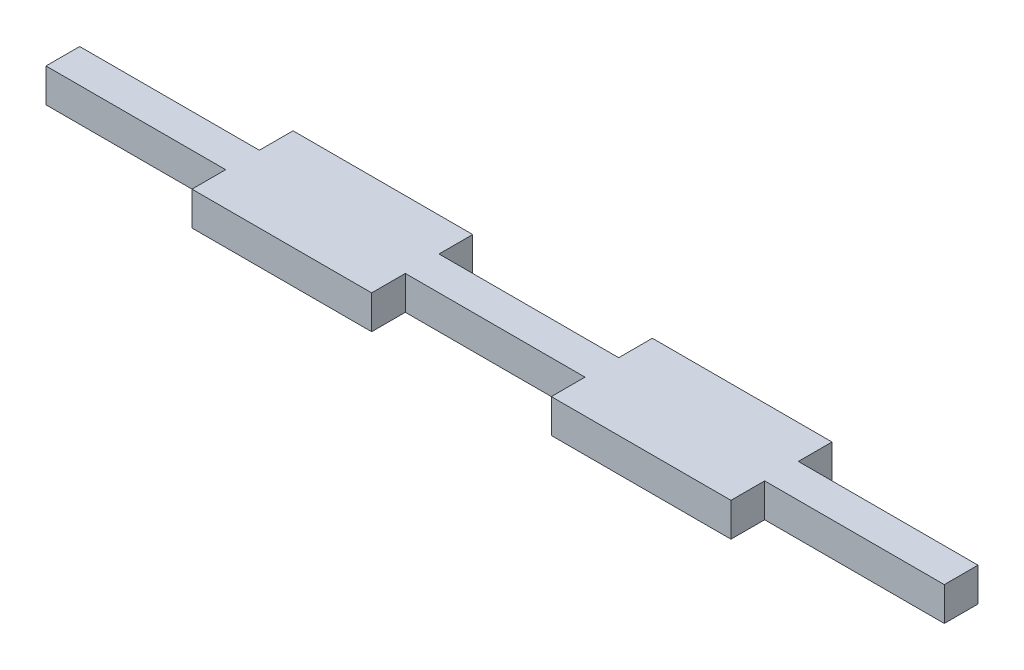
ISO-10303-21;
HEADER;
FILE_DESCRIPTION(('STEP AP214'),'2;1');
FILE_NAME('part.step','',(''),(''),'','','');
FILE_SCHEMA(('AUTOMOTIVE_DESIGN { 1 0 10303 214 1 1 1 1 }'));
ENDSEC;
DATA;
#1=APPLICATION_CONTEXT('core data for automotive mechanical design processes');
#2=APPLICATION_PROTOCOL_DEFINITION('international standard','automotive_design',2000,#1);
#3=PRODUCT_CONTEXT('',#1,'mechanical');
#4=PRODUCT('Part','Part','',(#3));
#5=PRODUCT_RELATED_PRODUCT_CATEGORY('part','',(#4));
#6=PRODUCT_DEFINITION_FORMATION('','',#4);
#7=PRODUCT_DEFINITION_CONTEXT('part definition',#1,'design');
#8=PRODUCT_DEFINITION('design','',#6,#7);
#9=PRODUCT_DEFINITION_SHAPE('','',#8);
#10=(LENGTH_UNIT() NAMED_UNIT(*) SI_UNIT(.MILLI.,.METRE.));
#11=(NAMED_UNIT(*) PLANE_ANGLE_UNIT() SI_UNIT($,.RADIAN.));
#12=(NAMED_UNIT(*) SI_UNIT($,.STERADIAN.) SOLID_ANGLE_UNIT());
#13=UNCERTAINTY_MEASURE_WITH_UNIT(LENGTH_MEASURE(1.E-05),#10,'distance_accuracy_value','');
#14=(GEOMETRIC_REPRESENTATION_CONTEXT(3) GLOBAL_UNCERTAINTY_ASSIGNED_CONTEXT((#13)) GLOBAL_UNIT_ASSIGNED_CONTEXT((#10,
#11,#12)) REPRESENTATION_CONTEXT('',''));
#15=CARTESIAN_POINT('',(0.,0.,0.));
#16=DIRECTION('',(0.,0.,1.));
#17=DIRECTION('',(1.,0.,0.));
#18=AXIS2_PLACEMENT_3D('',#15,#16,#17);
#19=CARTESIAN_POINT('',(-24.,3.,-1.5));
#20=DIRECTION('',(1.,0.,0.));
#21=DIRECTION('',(0.,0.,-1.));
#22=AXIS2_PLACEMENT_3D('',#19,#20,#21);
#23=PLANE('',#22);
#24=DIRECTION('',(0.,0.,1.));
#25=VECTOR('',#24,1.);
#26=CARTESIAN_POINT('',(-24.,0.,-1.5));
#27=LINE('',#26,#25);
#28=CARTESIAN_POINT('',(-24.,0.,-4.5));
#29=VERTEX_POINT('',#28);
#30=CARTESIAN_POINT('',(-24.,0.,-1.5));
#31=VERTEX_POINT('',#30);
#32=EDGE_CURVE('E201',#29,#31,#27,.T.);
#33=ORIENTED_EDGE('',*,*,#32,.T.);
#34=DIRECTION('',(0.,-1.,0.));
#35=VECTOR('',#34,1.);
#36=CARTESIAN_POINT('',(-24.,3.,-1.5));
#37=LINE('',#36,#35);
#38=CARTESIAN_POINT('',(-24.,3.,-1.5));
#39=VERTEX_POINT('',#38);
#40=EDGE_CURVE('E11',#39,#31,#37,.T.);
#41=ORIENTED_EDGE('',*,*,#40,.F.);
#42=DIRECTION('',(0.,0.,1.));
#43=VECTOR('',#42,1.);
#44=CARTESIAN_POINT('',(-24.,3.,-1.5));
#45=LINE('',#44,#43);
#46=CARTESIAN_POINT('',(-24.,3.,-4.5));
#47=VERTEX_POINT('',#46);
#48=EDGE_CURVE('E239',#47,#39,#45,.T.);
#49=ORIENTED_EDGE('',*,*,#48,.F.);
#50=DIRECTION('',(0.,-1.,0.));
#51=VECTOR('',#50,1.);
#52=CARTESIAN_POINT('',(-24.,3.,-4.5));
#53=LINE('',#52,#51);
#54=EDGE_CURVE('E197',#47,#29,#53,.T.);
#55=ORIENTED_EDGE('',*,*,#54,.T.);
#56=EDGE_LOOP('',(#33,#41,#49,#55));
#57=FACE_BOUND('',#56,.T.);
#58=ADVANCED_FACE('F33',(#57),#23,.F.);
#59=CARTESIAN_POINT('',(-40.,3.,-1.5));
#60=DIRECTION('',(0.,0.,1.));
#61=DIRECTION('',(1.,0.,0.));
#62=AXIS2_PLACEMENT_3D('',#59,#60,#61);
#63=PLANE('',#62);
#64=DIRECTION('',(-1.,0.,0.));
#65=VECTOR('',#64,1.);
#66=CARTESIAN_POINT('',(-40.,0.,-1.5));
#67=LINE('',#66,#65);
#68=CARTESIAN_POINT('',(-40.,0.,-1.5));
#69=VERTEX_POINT('',#68);
#70=EDGE_CURVE('E204',#31,#69,#67,.T.);
#71=ORIENTED_EDGE('',*,*,#70,.T.);
#72=DIRECTION('',(0.,-1.,0.));
#73=VECTOR('',#72,1.);
#74=CARTESIAN_POINT('',(-40.,3.,-1.5));
#75=LINE('',#74,#73);
#76=CARTESIAN_POINT('',(-40.,3.,-1.5));
#77=VERTEX_POINT('',#76);
#78=EDGE_CURVE('E41',#77,#69,#75,.T.);
#79=ORIENTED_EDGE('',*,*,#78,.F.);
#80=DIRECTION('',(-1.,0.,0.));
#81=VECTOR('',#80,1.);
#82=CARTESIAN_POINT('',(-40.,3.,-1.5));
#83=LINE('',#82,#81);
#84=EDGE_CURVE('E128',#39,#77,#83,.T.);
#85=ORIENTED_EDGE('',*,*,#84,.F.);
#86=ORIENTED_EDGE('',*,*,#40,.T.);
#87=EDGE_LOOP('',(#71,#79,#85,#86));
#88=FACE_BOUND('',#87,.T.);
#89=ADVANCED_FACE('F357',(#88),#63,.F.);
#90=CARTESIAN_POINT('',(-40.,3.,1.5));
#91=DIRECTION('',(1.,0.,0.));
#92=DIRECTION('',(0.,0.,-1.));
#93=AXIS2_PLACEMENT_3D('',#90,#91,#92);
#94=PLANE('',#93);
#95=DIRECTION('',(0.,0.,1.));
#96=VECTOR('',#95,1.);
#97=CARTESIAN_POINT('',(-40.,0.,1.5));
#98=LINE('',#97,#96);
#99=CARTESIAN_POINT('',(-40.,0.,1.5));
#100=VERTEX_POINT('',#99);
#101=EDGE_CURVE('E206',#69,#100,#98,.T.);
#102=ORIENTED_EDGE('',*,*,#101,.T.);
#103=DIRECTION('',(0.,-1.,0.));
#104=VECTOR('',#103,1.);
#105=CARTESIAN_POINT('',(-40.,3.,1.5));
#106=LINE('',#105,#104);
#107=CARTESIAN_POINT('',(-40.,3.,1.5));
#108=VERTEX_POINT('',#107);
#109=EDGE_CURVE('E282',#108,#100,#106,.T.);
#110=ORIENTED_EDGE('',*,*,#109,.F.);
#111=DIRECTION('',(0.,0.,1.));
#112=VECTOR('',#111,1.);
#113=CARTESIAN_POINT('',(-40.,3.,1.5));
#114=LINE('',#113,#112);
#115=EDGE_CURVE('E290',#77,#108,#114,.T.);
#116=ORIENTED_EDGE('',*,*,#115,.F.);
#117=ORIENTED_EDGE('',*,*,#78,.T.);
#118=EDGE_LOOP('',(#102,#110,#116,#117));
#119=FACE_BOUND('',#118,.T.);
#120=ADVANCED_FACE('F288',(#119),#94,.F.);
#121=CARTESIAN_POINT('',(-24.,3.,1.5));
#122=DIRECTION('',(0.,0.,-1.));
#123=DIRECTION('',(-1.,0.,0.));
#124=AXIS2_PLACEMENT_3D('',#121,#122,#123);
#125=PLANE('',#124);
#126=DIRECTION('',(1.,0.,0.));
#127=VECTOR('',#126,1.);
#128=CARTESIAN_POINT('',(-24.,0.,1.5));
#129=LINE('',#128,#127);
#130=CARTESIAN_POINT('',(-24.,0.,1.5));
#131=VERTEX_POINT('',#130);
#132=EDGE_CURVE('E208',#100,#131,#129,.T.);
#133=ORIENTED_EDGE('',*,*,#132,.T.);
#134=DIRECTION('',(0.,-1.,0.));
#135=VECTOR('',#134,1.);
#136=CARTESIAN_POINT('',(-24.,3.,1.5));
#137=LINE('',#136,#135);
#138=CARTESIAN_POINT('',(-24.,3.,1.5));
#139=VERTEX_POINT('',#138);
#140=EDGE_CURVE('E279',#139,#131,#137,.T.);
#141=ORIENTED_EDGE('',*,*,#140,.F.);
#142=DIRECTION('',(1.,0.,0.));
#143=VECTOR('',#142,1.);
#144=CARTESIAN_POINT('',(-24.,3.,1.5));
#145=LINE('',#144,#143);
#146=EDGE_CURVE('E308',#108,#139,#145,.T.);
#147=ORIENTED_EDGE('',*,*,#146,.F.);
#148=ORIENTED_EDGE('',*,*,#109,.T.);
#149=EDGE_LOOP('',(#133,#141,#147,#148));
#150=FACE_BOUND('',#149,.T.);
#151=ADVANCED_FACE('F299',(#150),#125,.F.);
#152=CARTESIAN_POINT('',(-24.,3.,4.5));
#153=DIRECTION('',(1.,0.,0.));
#154=DIRECTION('',(0.,0.,-1.));
#155=AXIS2_PLACEMENT_3D('',#152,#153,#154);
#156=PLANE('',#155);
#157=DIRECTION('',(0.,0.,1.));
#158=VECTOR('',#157,1.);
#159=CARTESIAN_POINT('',(-24.,0.,4.5));
#160=LINE('',#159,#158);
#161=CARTESIAN_POINT('',(-24.,0.,4.5));
#162=VERTEX_POINT('',#161);
#163=EDGE_CURVE('E210',#131,#162,#160,.T.);
#164=ORIENTED_EDGE('',*,*,#163,.T.);
#165=DIRECTION('',(0.,-1.,0.));
#166=VECTOR('',#165,1.);
#167=CARTESIAN_POINT('',(-24.,3.,4.5));
#168=LINE('',#167,#166);
#169=CARTESIAN_POINT('',(-24.,3.,4.5));
#170=VERTEX_POINT('',#169);
#171=EDGE_CURVE('E276',#170,#162,#168,.T.);
#172=ORIENTED_EDGE('',*,*,#171,.F.);
#173=DIRECTION('',(0.,0.,1.));
#174=VECTOR('',#173,1.);
#175=CARTESIAN_POINT('',(-24.,3.,4.5));
#176=LINE('',#175,#174);
#177=EDGE_CURVE('E305',#139,#170,#176,.T.);
#178=ORIENTED_EDGE('',*,*,#177,.F.);
#179=ORIENTED_EDGE('',*,*,#140,.T.);
#180=EDGE_LOOP('',(#164,#172,#178,#179));
#181=FACE_BOUND('',#180,.T.);
#182=ADVANCED_FACE('F303',(#181),#156,.F.);
#183=CARTESIAN_POINT('',(-24.,3.,4.5));
#184=DIRECTION('',(0.,0.,-1.));
#185=DIRECTION('',(-1.,0.,0.));
#186=AXIS2_PLACEMENT_3D('',#183,#184,#185);
#187=PLANE('',#186);
#188=DIRECTION('',(1.,0.,0.));
#189=VECTOR('',#188,1.);
#190=CARTESIAN_POINT('',(-24.,0.,4.5));
#191=LINE('',#190,#189);
#192=CARTESIAN_POINT('',(-8.00000000000001,0.,4.5));
#193=VERTEX_POINT('',#192);
#194=EDGE_CURVE('E212',#162,#193,#191,.T.);
#195=ORIENTED_EDGE('',*,*,#194,.T.);
#196=DIRECTION('',(0.,-1.,0.));
#197=VECTOR('',#196,1.);
#198=CARTESIAN_POINT('',(-8.00000000000001,3.,4.5));
#199=LINE('',#198,#197);
#200=CARTESIAN_POINT('',(-8.00000000000001,3.,4.5));
#201=VERTEX_POINT('',#200);
#202=EDGE_CURVE('E273',#201,#193,#199,.T.);
#203=ORIENTED_EDGE('',*,*,#202,.F.);
#204=DIRECTION('',(1.,0.,0.));
#205=VECTOR('',#204,1.);
#206=CARTESIAN_POINT('',(-24.,3.,4.5));
#207=LINE('',#206,#205);
#208=EDGE_CURVE('E307',#170,#201,#207,.T.);
#209=ORIENTED_EDGE('',*,*,#208,.F.);
#210=ORIENTED_EDGE('',*,*,#171,.T.);
#211=EDGE_LOOP('',(#195,#203,#209,#210));
#212=FACE_BOUND('',#211,.T.);
#213=ADVANCED_FACE('F370',(#212),#187,.F.);
#214=CARTESIAN_POINT('',(-8.00000000000001,3.,4.5));
#215=DIRECTION('',(-1.,0.,0.));
#216=DIRECTION('',(0.,0.,1.));
#217=AXIS2_PLACEMENT_3D('',#214,#215,#216);
#218=PLANE('',#217);
#219=DIRECTION('',(0.,0.,-1.));
#220=VECTOR('',#219,1.);
#221=CARTESIAN_POINT('',(-8.00000000000001,0.,4.5));
#222=LINE('',#221,#220);
#223=CARTESIAN_POINT('',(-8.00000000000001,0.,1.5));
#224=VERTEX_POINT('',#223);
#225=EDGE_CURVE('E214',#193,#224,#222,.T.);
#226=ORIENTED_EDGE('',*,*,#225,.T.);
#227=DIRECTION('',(0.,-1.,0.));
#228=VECTOR('',#227,1.);
#229=CARTESIAN_POINT('',(-8.00000000000001,3.,1.5));
#230=LINE('',#229,#228);
#231=CARTESIAN_POINT('',(-8.00000000000001,3.,1.5));
#232=VERTEX_POINT('',#231);
#233=EDGE_CURVE('E270',#232,#224,#230,.T.);
#234=ORIENTED_EDGE('',*,*,#233,.F.);
#235=DIRECTION('',(0.,0.,-1.));
#236=VECTOR('',#235,1.);
#237=CARTESIAN_POINT('',(-8.00000000000001,3.,4.5));
#238=LINE('',#237,#236);
#239=EDGE_CURVE('E310',#201,#232,#238,.T.);
#240=ORIENTED_EDGE('',*,*,#239,.F.);
#241=ORIENTED_EDGE('',*,*,#202,.T.);
#242=EDGE_LOOP('',(#226,#234,#240,#241));
#243=FACE_BOUND('',#242,.T.);
#244=ADVANCED_FACE('F373',(#243),#218,.F.);
#245=CARTESIAN_POINT('',(-8.00000000000001,3.,1.5));
#246=DIRECTION('',(0.,0.,-1.));
#247=DIRECTION('',(-1.,0.,0.));
#248=AXIS2_PLACEMENT_3D('',#245,#246,#247);
#249=PLANE('',#248);
#250=DIRECTION('',(1.,0.,0.));
#251=VECTOR('',#250,1.);
#252=CARTESIAN_POINT('',(-8.00000000000001,0.,1.5));
#253=LINE('',#252,#251);
#254=CARTESIAN_POINT('',(7.99999999999999,0.,1.5));
#255=VERTEX_POINT('',#254);
#256=EDGE_CURVE('E216',#224,#255,#253,.T.);
#257=ORIENTED_EDGE('',*,*,#256,.T.);
#258=DIRECTION('',(0.,-1.,0.));
#259=VECTOR('',#258,1.);
#260=CARTESIAN_POINT('',(7.99999999999999,3.,1.5));
#261=LINE('',#260,#259);
#262=CARTESIAN_POINT('',(7.99999999999999,3.,1.5));
#263=VERTEX_POINT('',#262);
#264=EDGE_CURVE('E267',#263,#255,#261,.T.);
#265=ORIENTED_EDGE('',*,*,#264,.F.);
#266=DIRECTION('',(1.,0.,0.));
#267=VECTOR('',#266,1.);
#268=CARTESIAN_POINT('',(-8.00000000000001,3.,1.5));
#269=LINE('',#268,#267);
#270=EDGE_CURVE('E316',#232,#263,#269,.T.);
#271=ORIENTED_EDGE('',*,*,#270,.F.);
#272=ORIENTED_EDGE('',*,*,#233,.T.);
#273=EDGE_LOOP('',(#257,#265,#271,#272));
#274=FACE_BOUND('',#273,.T.);
#275=ADVANCED_FACE('F377',(#274),#249,.F.);
#276=CARTESIAN_POINT('',(7.99999999999999,3.,1.5));
#277=DIRECTION('',(1.,0.,0.));
#278=DIRECTION('',(0.,0.,-1.));
#279=AXIS2_PLACEMENT_3D('',#276,#277,#278);
#280=PLANE('',#279);
#281=DIRECTION('',(0.,0.,1.));
#282=VECTOR('',#281,1.);
#283=CARTESIAN_POINT('',(7.99999999999999,0.,1.5));
#284=LINE('',#283,#282);
#285=CARTESIAN_POINT('',(7.99999999999999,0.,4.5));
#286=VERTEX_POINT('',#285);
#287=EDGE_CURVE('E218',#255,#286,#284,.T.);
#288=ORIENTED_EDGE('',*,*,#287,.T.);
#289=DIRECTION('',(0.,-1.,0.));
#290=VECTOR('',#289,1.);
#291=CARTESIAN_POINT('',(7.99999999999999,3.,4.5));
#292=LINE('',#291,#290);
#293=CARTESIAN_POINT('',(7.99999999999999,3.,4.5));
#294=VERTEX_POINT('',#293);
#295=EDGE_CURVE('E264',#294,#286,#292,.T.);
#296=ORIENTED_EDGE('',*,*,#295,.F.);
#297=DIRECTION('',(0.,0.,1.));
#298=VECTOR('',#297,1.);
#299=CARTESIAN_POINT('',(7.99999999999999,3.,1.5));
#300=LINE('',#299,#298);
#301=EDGE_CURVE('E318',#263,#294,#300,.T.);
#302=ORIENTED_EDGE('',*,*,#301,.F.);
#303=ORIENTED_EDGE('',*,*,#264,.T.);
#304=EDGE_LOOP('',(#288,#296,#302,#303));
#305=FACE_BOUND('',#304,.T.);
#306=ADVANCED_FACE('F381',(#305),#280,.F.);
#307=CARTESIAN_POINT('',(7.99999999999999,3.,4.5));
#308=DIRECTION('',(0.,0.,-1.));
#309=DIRECTION('',(-1.,0.,0.));
#310=AXIS2_PLACEMENT_3D('',#307,#308,#309);
#311=PLANE('',#310);
#312=DIRECTION('',(1.,0.,0.));
#313=VECTOR('',#312,1.);
#314=CARTESIAN_POINT('',(7.99999999999999,0.,4.5));
#315=LINE('',#314,#313);
#316=CARTESIAN_POINT('',(24.,0.,4.5));
#317=VERTEX_POINT('',#316);
#318=EDGE_CURVE('E220',#286,#317,#315,.T.);
#319=ORIENTED_EDGE('',*,*,#318,.T.);
#320=DIRECTION('',(0.,-1.,0.));
#321=VECTOR('',#320,1.);
#322=CARTESIAN_POINT('',(24.,3.,4.5));
#323=LINE('',#322,#321);
#324=CARTESIAN_POINT('',(24.,3.,4.5));
#325=VERTEX_POINT('',#324);
#326=EDGE_CURVE('E261',#325,#317,#323,.T.);
#327=ORIENTED_EDGE('',*,*,#326,.F.);
#328=DIRECTION('',(1.,0.,0.));
#329=VECTOR('',#328,1.);
#330=CARTESIAN_POINT('',(7.99999999999999,3.,4.5));
#331=LINE('',#330,#329);
#332=EDGE_CURVE('E320',#294,#325,#331,.T.);
#333=ORIENTED_EDGE('',*,*,#332,.F.);
#334=ORIENTED_EDGE('',*,*,#295,.T.);
#335=EDGE_LOOP('',(#319,#327,#333,#334));
#336=FACE_BOUND('',#335,.T.);
#337=ADVANCED_FACE('F385',(#336),#311,.F.);
#338=CARTESIAN_POINT('',(24.,3.,4.5));
#339=DIRECTION('',(-1.,0.,0.));
#340=DIRECTION('',(0.,0.,1.));
#341=AXIS2_PLACEMENT_3D('',#338,#339,#340);
#342=PLANE('',#341);
#343=DIRECTION('',(0.,0.,-1.));
#344=VECTOR('',#343,1.);
#345=CARTESIAN_POINT('',(24.,0.,4.5));
#346=LINE('',#345,#344);
#347=CARTESIAN_POINT('',(24.,0.,1.5));
#348=VERTEX_POINT('',#347);
#349=EDGE_CURVE('E222',#317,#348,#346,.T.);
#350=ORIENTED_EDGE('',*,*,#349,.T.);
#351=DIRECTION('',(0.,-1.,0.));
#352=VECTOR('',#351,1.);
#353=CARTESIAN_POINT('',(24.,3.,1.5));
#354=LINE('',#353,#352);
#355=CARTESIAN_POINT('',(24.,3.,1.5));
#356=VERTEX_POINT('',#355);
#357=EDGE_CURVE('E258',#356,#348,#354,.T.);
#358=ORIENTED_EDGE('',*,*,#357,.F.);
#359=DIRECTION('',(0.,0.,-1.));
#360=VECTOR('',#359,1.);
#361=CARTESIAN_POINT('',(24.,3.,4.5));
#362=LINE('',#361,#360);
#363=EDGE_CURVE('E322',#325,#356,#362,.T.);
#364=ORIENTED_EDGE('',*,*,#363,.F.);
#365=ORIENTED_EDGE('',*,*,#326,.T.);
#366=EDGE_LOOP('',(#350,#358,#364,#365));
#367=FACE_BOUND('',#366,.T.);
#368=ADVANCED_FACE('F389',(#367),#342,.F.);
#369=CARTESIAN_POINT('',(24.,3.,1.5));
#370=DIRECTION('',(0.,0.,-1.));
#371=DIRECTION('',(-1.,0.,0.));
#372=AXIS2_PLACEMENT_3D('',#369,#370,#371);
#373=PLANE('',#372);
#374=DIRECTION('',(1.,0.,0.));
#375=VECTOR('',#374,1.);
#376=CARTESIAN_POINT('',(24.,0.,1.5));
#377=LINE('',#376,#375);
#378=CARTESIAN_POINT('',(40.,0.,1.5));
#379=VERTEX_POINT('',#378);
#380=EDGE_CURVE('E224',#348,#379,#377,.T.);
#381=ORIENTED_EDGE('',*,*,#380,.T.);
#382=DIRECTION('',(0.,-1.,0.));
#383=VECTOR('',#382,1.);
#384=CARTESIAN_POINT('',(40.,3.,1.5));
#385=LINE('',#384,#383);
#386=CARTESIAN_POINT('',(40.,3.,1.5));
#387=VERTEX_POINT('',#386);
#388=EDGE_CURVE('E255',#387,#379,#385,.T.);
#389=ORIENTED_EDGE('',*,*,#388,.F.);
#390=DIRECTION('',(1.,0.,0.));
#391=VECTOR('',#390,1.);
#392=CARTESIAN_POINT('',(24.,3.,1.5));
#393=LINE('',#392,#391);
#394=EDGE_CURVE('E324',#356,#387,#393,.T.);
#395=ORIENTED_EDGE('',*,*,#394,.F.);
#396=ORIENTED_EDGE('',*,*,#357,.T.);
#397=EDGE_LOOP('',(#381,#389,#395,#396));
#398=FACE_BOUND('',#397,.T.);
#399=ADVANCED_FACE('F393',(#398),#373,.F.);
#400=CARTESIAN_POINT('',(40.,3.,1.5));
#401=DIRECTION('',(-1.,0.,0.));
#402=DIRECTION('',(0.,0.,1.));
#403=AXIS2_PLACEMENT_3D('',#400,#401,#402);
#404=PLANE('',#403);
#405=DIRECTION('',(0.,0.,-1.));
#406=VECTOR('',#405,1.);
#407=CARTESIAN_POINT('',(40.,0.,1.5));
#408=LINE('',#407,#406);
#409=CARTESIAN_POINT('',(40.,0.,-1.5));
#410=VERTEX_POINT('',#409);
#411=EDGE_CURVE('E226',#379,#410,#408,.T.);
#412=ORIENTED_EDGE('',*,*,#411,.T.);
#413=DIRECTION('',(0.,-1.,0.));
#414=VECTOR('',#413,1.);
#415=CARTESIAN_POINT('',(40.,3.,-1.5));
#416=LINE('',#415,#414);
#417=CARTESIAN_POINT('',(40.,3.,-1.5));
#418=VERTEX_POINT('',#417);
#419=EDGE_CURVE('E252',#418,#410,#416,.T.);
#420=ORIENTED_EDGE('',*,*,#419,.F.);
#421=DIRECTION('',(0.,0.,-1.));
#422=VECTOR('',#421,1.);
#423=CARTESIAN_POINT('',(40.,3.,1.5));
#424=LINE('',#423,#422);
#425=EDGE_CURVE('E326',#387,#418,#424,.T.);
#426=ORIENTED_EDGE('',*,*,#425,.F.);
#427=ORIENTED_EDGE('',*,*,#388,.T.);
#428=EDGE_LOOP('',(#412,#420,#426,#427));
#429=FACE_BOUND('',#428,.T.);
#430=ADVANCED_FACE('F397',(#429),#404,.F.);
#431=CARTESIAN_POINT('',(24.,3.,-1.5));
#432=DIRECTION('',(0.,0.,1.));
#433=DIRECTION('',(1.,0.,0.));
#434=AXIS2_PLACEMENT_3D('',#431,#432,#433);
#435=PLANE('',#434);
#436=DIRECTION('',(-1.,0.,0.));
#437=VECTOR('',#436,1.);
#438=CARTESIAN_POINT('',(24.,0.,-1.5));
#439=LINE('',#438,#437);
#440=CARTESIAN_POINT('',(24.,0.,-1.5));
#441=VERTEX_POINT('',#440);
#442=EDGE_CURVE('E228',#410,#441,#439,.T.);
#443=ORIENTED_EDGE('',*,*,#442,.T.);
#444=DIRECTION('',(0.,-1.,0.));
#445=VECTOR('',#444,1.);
#446=CARTESIAN_POINT('',(24.,3.,-1.5));
#447=LINE('',#446,#445);
#448=CARTESIAN_POINT('',(24.,3.,-1.5));
#449=VERTEX_POINT('',#448);
#450=EDGE_CURVE('E249',#449,#441,#447,.T.);
#451=ORIENTED_EDGE('',*,*,#450,.F.);
#452=DIRECTION('',(-1.,0.,0.));
#453=VECTOR('',#452,1.);
#454=CARTESIAN_POINT('',(24.,3.,-1.5));
#455=LINE('',#454,#453);
#456=EDGE_CURVE('E328',#418,#449,#455,.T.);
#457=ORIENTED_EDGE('',*,*,#456,.F.);
#458=ORIENTED_EDGE('',*,*,#419,.T.);
#459=EDGE_LOOP('',(#443,#451,#457,#458));
#460=FACE_BOUND('',#459,.T.);
#461=ADVANCED_FACE('F401',(#460),#435,.F.);
#462=CARTESIAN_POINT('',(24.,3.,-4.5));
#463=DIRECTION('',(-1.,0.,0.));
#464=DIRECTION('',(0.,0.,1.));
#465=AXIS2_PLACEMENT_3D('',#462,#463,#464);
#466=PLANE('',#465);
#467=DIRECTION('',(0.,0.,-1.));
#468=VECTOR('',#467,1.);
#469=CARTESIAN_POINT('',(24.,0.,-4.5));
#470=LINE('',#469,#468);
#471=CARTESIAN_POINT('',(24.,0.,-4.5));
#472=VERTEX_POINT('',#471);
#473=EDGE_CURVE('E230',#441,#472,#470,.T.);
#474=ORIENTED_EDGE('',*,*,#473,.T.);
#475=DIRECTION('',(0.,-1.,0.));
#476=VECTOR('',#475,1.);
#477=CARTESIAN_POINT('',(24.,3.,-4.5));
#478=LINE('',#477,#476);
#479=CARTESIAN_POINT('',(24.,3.,-4.5));
#480=VERTEX_POINT('',#479);
#481=EDGE_CURVE('E246',#480,#472,#478,.T.);
#482=ORIENTED_EDGE('',*,*,#481,.F.);
#483=DIRECTION('',(0.,0.,-1.));
#484=VECTOR('',#483,1.);
#485=CARTESIAN_POINT('',(24.,3.,-4.5));
#486=LINE('',#485,#484);
#487=EDGE_CURVE('E330',#449,#480,#486,.T.);
#488=ORIENTED_EDGE('',*,*,#487,.F.);
#489=ORIENTED_EDGE('',*,*,#450,.T.);
#490=EDGE_LOOP('',(#474,#482,#488,#489));
#491=FACE_BOUND('',#490,.T.);
#492=ADVANCED_FACE('F405',(#491),#466,.F.);
#493=CARTESIAN_POINT('',(7.99999999999999,3.,-4.5));
#494=DIRECTION('',(0.,0.,1.));
#495=DIRECTION('',(1.,0.,0.));
#496=AXIS2_PLACEMENT_3D('',#493,#494,#495);
#497=PLANE('',#496);
#498=DIRECTION('',(-1.,0.,0.));
#499=VECTOR('',#498,1.);
#500=CARTESIAN_POINT('',(7.99999999999999,0.,-4.5));
#501=LINE('',#500,#499);
#502=CARTESIAN_POINT('',(7.99999999999999,0.,-4.5));
#503=VERTEX_POINT('',#502);
#504=EDGE_CURVE('E232',#472,#503,#501,.T.);
#505=ORIENTED_EDGE('',*,*,#504,.T.);
#506=DIRECTION('',(0.,-1.,0.));
#507=VECTOR('',#506,1.);
#508=CARTESIAN_POINT('',(7.99999999999999,3.,-4.5));
#509=LINE('',#508,#507);
#510=CARTESIAN_POINT('',(7.99999999999999,3.,-4.5));
#511=VERTEX_POINT('',#510);
#512=EDGE_CURVE('E243',#511,#503,#509,.T.);
#513=ORIENTED_EDGE('',*,*,#512,.F.);
#514=DIRECTION('',(-1.,0.,0.));
#515=VECTOR('',#514,1.);
#516=CARTESIAN_POINT('',(7.99999999999999,3.,-4.5));
#517=LINE('',#516,#515);
#518=EDGE_CURVE('E332',#480,#511,#517,.T.);
#519=ORIENTED_EDGE('',*,*,#518,.F.);
#520=ORIENTED_EDGE('',*,*,#481,.T.);
#521=EDGE_LOOP('',(#505,#513,#519,#520));
#522=FACE_BOUND('',#521,.T.);
#523=ADVANCED_FACE('F338',(#522),#497,.F.);
#524=CARTESIAN_POINT('',(7.99999999999999,3.,-1.5));
#525=DIRECTION('',(1.,0.,0.));
#526=DIRECTION('',(0.,0.,-1.));
#527=AXIS2_PLACEMENT_3D('',#524,#525,#526);
#528=PLANE('',#527);
#529=DIRECTION('',(0.,0.,1.));
#530=VECTOR('',#529,1.);
#531=CARTESIAN_POINT('',(7.99999999999999,0.,-1.5));
#532=LINE('',#531,#530);
#533=CARTESIAN_POINT('',(7.99999999999999,0.,-1.5));
#534=VERTEX_POINT('',#533);
#535=EDGE_CURVE('E234',#503,#534,#532,.T.);
#536=ORIENTED_EDGE('',*,*,#535,.T.);
#537=DIRECTION('',(0.,-1.,0.));
#538=VECTOR('',#537,1.);
#539=CARTESIAN_POINT('',(7.99999999999999,3.,-1.5));
#540=LINE('',#539,#538);
#541=CARTESIAN_POINT('',(7.99999999999999,3.,-1.5));
#542=VERTEX_POINT('',#541);
#543=EDGE_CURVE('E192',#542,#534,#540,.T.);
#544=ORIENTED_EDGE('',*,*,#543,.F.);
#545=DIRECTION('',(0.,0.,1.));
#546=VECTOR('',#545,1.);
#547=CARTESIAN_POINT('',(7.99999999999999,3.,-1.5));
#548=LINE('',#547,#546);
#549=EDGE_CURVE('E183',#511,#542,#548,.T.);
#550=ORIENTED_EDGE('',*,*,#549,.F.);
#551=ORIENTED_EDGE('',*,*,#512,.T.);
#552=EDGE_LOOP('',(#536,#544,#550,#551));
#553=FACE_BOUND('',#552,.T.);
#554=ADVANCED_FACE('F342',(#553),#528,.F.);
#555=CARTESIAN_POINT('',(-8.00000000000001,3.,-1.5));
#556=DIRECTION('',(0.,0.,1.));
#557=DIRECTION('',(1.,0.,0.));
#558=AXIS2_PLACEMENT_3D('',#555,#556,#557);
#559=PLANE('',#558);
#560=DIRECTION('',(-1.,0.,0.));
#561=VECTOR('',#560,1.);
#562=CARTESIAN_POINT('',(-8.00000000000001,0.,-1.5));
#563=LINE('',#562,#561);
#564=CARTESIAN_POINT('',(-8.00000000000001,0.,-1.5));
#565=VERTEX_POINT('',#564);
#566=EDGE_CURVE('E191',#534,#565,#563,.T.);
#567=ORIENTED_EDGE('',*,*,#566,.T.);
#568=DIRECTION('',(0.,-1.,0.));
#569=VECTOR('',#568,1.);
#570=CARTESIAN_POINT('',(-8.00000000000001,3.,-1.5));
#571=LINE('',#570,#569);
#572=CARTESIAN_POINT('',(-8.00000000000001,3.,-1.5));
#573=VERTEX_POINT('',#572);
#574=EDGE_CURVE('E188',#573,#565,#571,.T.);
#575=ORIENTED_EDGE('',*,*,#574,.F.);
#576=DIRECTION('',(-1.,0.,0.));
#577=VECTOR('',#576,1.);
#578=CARTESIAN_POINT('',(-8.00000000000001,3.,-1.5));
#579=LINE('',#578,#577);
#580=EDGE_CURVE('E177',#542,#573,#579,.T.);
#581=ORIENTED_EDGE('',*,*,#580,.F.);
#582=ORIENTED_EDGE('',*,*,#543,.T.);
#583=EDGE_LOOP('',(#567,#575,#581,#582));
#584=FACE_BOUND('',#583,.T.);
#585=ADVANCED_FACE('F189',(#584),#559,.F.);
#586=CARTESIAN_POINT('',(-8.00000000000001,3.,-4.5));
#587=DIRECTION('',(-1.,0.,0.));
#588=DIRECTION('',(0.,0.,1.));
#589=AXIS2_PLACEMENT_3D('',#586,#587,#588);
#590=PLANE('',#589);
#591=DIRECTION('',(0.,0.,-1.));
#592=VECTOR('',#591,1.);
#593=CARTESIAN_POINT('',(-8.00000000000001,0.,-4.5));
#594=LINE('',#593,#592);
#595=CARTESIAN_POINT('',(-8.00000000000001,0.,-4.5));
#596=VERTEX_POINT('',#595);
#597=EDGE_CURVE('E114',#565,#596,#594,.T.);
#598=ORIENTED_EDGE('',*,*,#597,.T.);
#599=DIRECTION('',(0.,-1.,0.));
#600=VECTOR('',#599,1.);
#601=CARTESIAN_POINT('',(-8.00000000000001,3.,-4.5));
#602=LINE('',#601,#600);
#603=CARTESIAN_POINT('',(-8.00000000000001,3.,-4.5));
#604=VERTEX_POINT('',#603);
#605=EDGE_CURVE('E193',#604,#596,#602,.T.);
#606=ORIENTED_EDGE('',*,*,#605,.F.);
#607=DIRECTION('',(0.,0.,-1.));
#608=VECTOR('',#607,1.);
#609=CARTESIAN_POINT('',(-8.00000000000001,3.,-4.5));
#610=LINE('',#609,#608);
#611=EDGE_CURVE('E181',#573,#604,#610,.T.);
#612=ORIENTED_EDGE('',*,*,#611,.F.);
#613=ORIENTED_EDGE('',*,*,#574,.T.);
#614=EDGE_LOOP('',(#598,#606,#612,#613));
#615=FACE_BOUND('',#614,.T.);
#616=ADVANCED_FACE('F195',(#615),#590,.F.);
#617=CARTESIAN_POINT('',(-24.,3.,-4.5));
#618=DIRECTION('',(0.,0.,1.));
#619=DIRECTION('',(1.,0.,0.));
#620=AXIS2_PLACEMENT_3D('',#617,#618,#619);
#621=PLANE('',#620);
#622=DIRECTION('',(-1.,0.,0.));
#623=VECTOR('',#622,1.);
#624=CARTESIAN_POINT('',(-24.,0.,-4.5));
#625=LINE('',#624,#623);
#626=EDGE_CURVE('E120',#596,#29,#625,.T.);
#627=ORIENTED_EDGE('',*,*,#626,.T.);
#628=ORIENTED_EDGE('',*,*,#54,.F.);
#629=DIRECTION('',(-1.,0.,0.));
#630=VECTOR('',#629,1.);
#631=CARTESIAN_POINT('',(-24.,3.,-4.5));
#632=LINE('',#631,#630);
#633=EDGE_CURVE('E49',#604,#47,#632,.T.);
#634=ORIENTED_EDGE('',*,*,#633,.F.);
#635=ORIENTED_EDGE('',*,*,#605,.T.);
#636=EDGE_LOOP('',(#627,#628,#634,#635));
#637=FACE_BOUND('',#636,.T.);
#638=ADVANCED_FACE('F346',(#637),#621,.F.);
#639=CARTESIAN_POINT('',(0.,3.,0.));
#640=DIRECTION('',(0.,-1.,0.));
#641=DIRECTION('',(0.,0.,-1.));
#642=AXIS2_PLACEMENT_3D('',#639,#640,#641);
#643=PLANE('',#642);
#644=ORIENTED_EDGE('',*,*,#48,.T.);
#645=ORIENTED_EDGE('',*,*,#84,.T.);
#646=ORIENTED_EDGE('',*,*,#115,.T.);
#647=ORIENTED_EDGE('',*,*,#146,.T.);
#648=ORIENTED_EDGE('',*,*,#177,.T.);
#649=ORIENTED_EDGE('',*,*,#208,.T.);
#650=ORIENTED_EDGE('',*,*,#239,.T.);
#651=ORIENTED_EDGE('',*,*,#270,.T.);
#652=ORIENTED_EDGE('',*,*,#301,.T.);
#653=ORIENTED_EDGE('',*,*,#332,.T.);
#654=ORIENTED_EDGE('',*,*,#363,.T.);
#655=ORIENTED_EDGE('',*,*,#394,.T.);
#656=ORIENTED_EDGE('',*,*,#425,.T.);
#657=ORIENTED_EDGE('',*,*,#456,.T.);
#658=ORIENTED_EDGE('',*,*,#487,.T.);
#659=ORIENTED_EDGE('',*,*,#518,.T.);
#660=ORIENTED_EDGE('',*,*,#549,.T.);
#661=ORIENTED_EDGE('',*,*,#580,.T.);
#662=ORIENTED_EDGE('',*,*,#611,.T.);
#663=ORIENTED_EDGE('',*,*,#633,.T.);
#664=EDGE_LOOP('',(#644,#645,#646,#647,#648,#649,#650,#651,#652,#653,#654,#655,#656,#657,#658,
#659,#660,#661,#662,#663));
#665=FACE_BOUND('',#664,.T.);
#666=ADVANCED_FACE('F179',(#665),#643,.F.);
#667=CARTESIAN_POINT('',(0.,0.,0.));
#668=DIRECTION('',(0.,-1.,0.));
#669=DIRECTION('',(0.,0.,-1.));
#670=AXIS2_PLACEMENT_3D('',#667,#668,#669);
#671=PLANE('',#670);
#672=ORIENTED_EDGE('',*,*,#32,.F.);
#673=ORIENTED_EDGE('',*,*,#626,.F.);
#674=ORIENTED_EDGE('',*,*,#597,.F.);
#675=ORIENTED_EDGE('',*,*,#566,.F.);
#676=ORIENTED_EDGE('',*,*,#535,.F.);
#677=ORIENTED_EDGE('',*,*,#504,.F.);
#678=ORIENTED_EDGE('',*,*,#473,.F.);
#679=ORIENTED_EDGE('',*,*,#442,.F.);
#680=ORIENTED_EDGE('',*,*,#411,.F.);
#681=ORIENTED_EDGE('',*,*,#380,.F.);
#682=ORIENTED_EDGE('',*,*,#349,.F.);
#683=ORIENTED_EDGE('',*,*,#318,.F.);
#684=ORIENTED_EDGE('',*,*,#287,.F.);
#685=ORIENTED_EDGE('',*,*,#256,.F.);
#686=ORIENTED_EDGE('',*,*,#225,.F.);
#687=ORIENTED_EDGE('',*,*,#194,.F.);
#688=ORIENTED_EDGE('',*,*,#163,.F.);
#689=ORIENTED_EDGE('',*,*,#132,.F.);
#690=ORIENTED_EDGE('',*,*,#101,.F.);
#691=ORIENTED_EDGE('',*,*,#70,.F.);
#692=EDGE_LOOP('',(#672,#673,#674,#675,#676,#677,#678,#679,#680,#681,#682,#683,#684,#685,#686,
#687,#688,#689,#690,#691));
#693=FACE_BOUND('',#692,.T.);
#694=ADVANCED_FACE('F294',(#693),#671,.T.);
#695=CLOSED_SHELL('',(#58,#89,#120,#151,#182,#213,#244,#275,#306,#337,#368,#399,#430,#461,#492,
#523,#554,#585,#616,#638,#666,#694));
#696=MANIFOLD_SOLID_BREP('B2',#695);
#697=ADVANCED_BREP_SHAPE_REPRESENTATION('',(#18,#696),#14);
#698=SHAPE_DEFINITION_REPRESENTATION(#9,#697);
ENDSEC;
END-ISO-10303-21;
